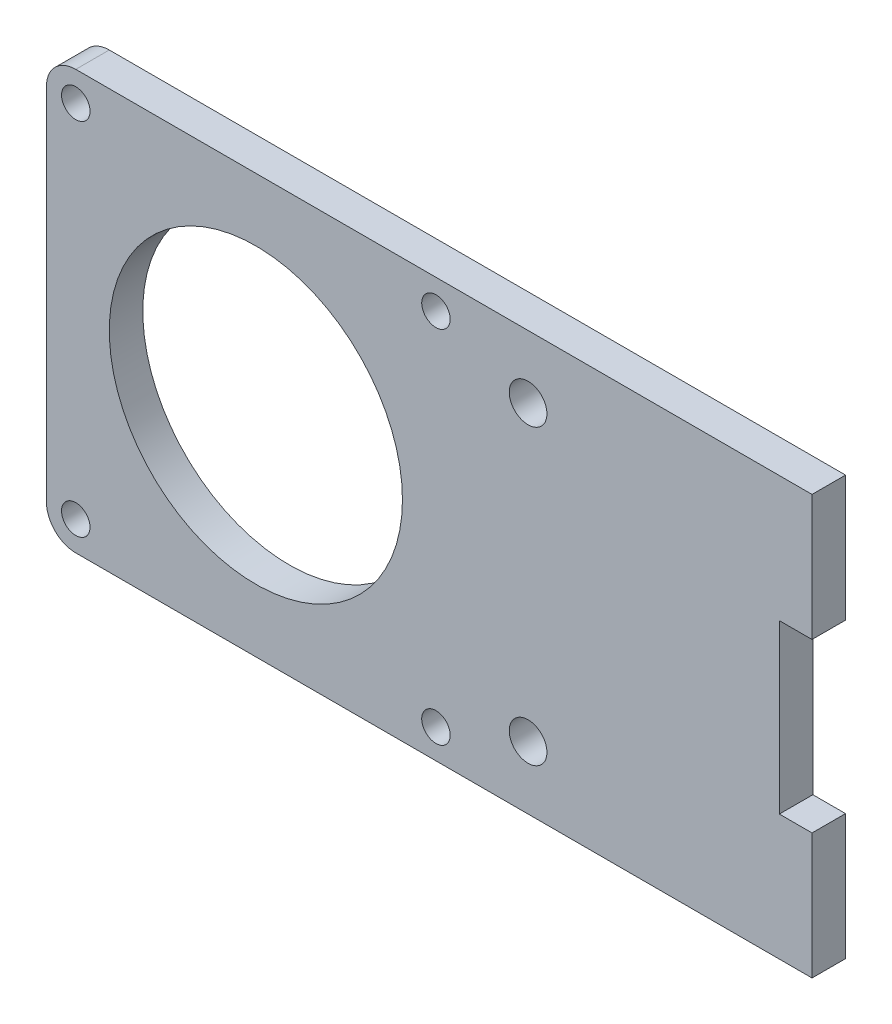
ISO-10303-21;
HEADER;
FILE_DESCRIPTION(('STEP AP214'),'2;1');
FILE_NAME('part.step','',(''),(''),'','','');
FILE_SCHEMA(('AUTOMOTIVE_DESIGN { 1 0 10303 214 1 1 1 1 }'));
ENDSEC;
DATA;
#1=APPLICATION_CONTEXT('core data for automotive mechanical design processes');
#2=APPLICATION_PROTOCOL_DEFINITION('international standard','automotive_design',2000,#1);
#3=PRODUCT_CONTEXT('',#1,'mechanical');
#4=PRODUCT('Part','Part','',(#3));
#5=PRODUCT_RELATED_PRODUCT_CATEGORY('part','',(#4));
#6=PRODUCT_DEFINITION_FORMATION('','',#4);
#7=PRODUCT_DEFINITION_CONTEXT('part definition',#1,'design');
#8=PRODUCT_DEFINITION('design','',#6,#7);
#9=PRODUCT_DEFINITION_SHAPE('','',#8);
#10=(LENGTH_UNIT() NAMED_UNIT(*) SI_UNIT(.MILLI.,.METRE.));
#11=(NAMED_UNIT(*) PLANE_ANGLE_UNIT() SI_UNIT($,.RADIAN.));
#12=(NAMED_UNIT(*) SI_UNIT($,.STERADIAN.) SOLID_ANGLE_UNIT());
#13=UNCERTAINTY_MEASURE_WITH_UNIT(LENGTH_MEASURE(1.E-05),#10,'distance_accuracy_value','');
#14=(GEOMETRIC_REPRESENTATION_CONTEXT(3) GLOBAL_UNCERTAINTY_ASSIGNED_CONTEXT((#13)) GLOBAL_UNIT_ASSIGNED_CONTEXT((#10,
#11,#12)) REPRESENTATION_CONTEXT('',''));
#15=CARTESIAN_POINT('',(0.,0.,0.));
#16=DIRECTION('',(0.,0.,1.));
#17=DIRECTION('',(1.,0.,0.));
#18=AXIS2_PLACEMENT_3D('',#15,#16,#17);
#19=CARTESIAN_POINT('',(0.,0.,4.));
#20=DIRECTION('',(-1.,0.,0.));
#21=DIRECTION('',(0.,0.,1.));
#22=AXIS2_PLACEMENT_3D('',#19,#20,#21);
#23=PLANE('',#22);
#24=DIRECTION('',(0.,1.,0.));
#25=VECTOR('',#24,1.);
#26=CARTESIAN_POINT('',(0.,0.,0.));
#27=LINE('',#26,#25);
#28=CARTESIAN_POINT('',(0.,15.,0.));
#29=VERTEX_POINT('',#28);
#30=CARTESIAN_POINT('',(0.,35.,0.));
#31=VERTEX_POINT('',#30);
#32=EDGE_CURVE('E150',#29,#31,#27,.T.);
#33=ORIENTED_EDGE('',*,*,#32,.T.);
#34=DIRECTION('',(0.,0.,-1.));
#35=VECTOR('',#34,1.);
#36=CARTESIAN_POINT('',(0.,35.,4.));
#37=LINE('',#36,#35);
#38=CARTESIAN_POINT('',(0.,35.,4.));
#39=VERTEX_POINT('',#38);
#40=EDGE_CURVE('E133',#39,#31,#37,.T.);
#41=ORIENTED_EDGE('',*,*,#40,.F.);
#42=DIRECTION('',(0.,1.,0.));
#43=VECTOR('',#42,1.);
#44=CARTESIAN_POINT('',(0.,0.,4.));
#45=LINE('',#44,#43);
#46=CARTESIAN_POINT('',(0.,15.,4.));
#47=VERTEX_POINT('',#46);
#48=EDGE_CURVE('E139',#47,#39,#45,.T.);
#49=ORIENTED_EDGE('',*,*,#48,.F.);
#50=DIRECTION('',(0.,0.,-1.));
#51=VECTOR('',#50,1.);
#52=CARTESIAN_POINT('',(0.,15.,4.));
#53=LINE('',#52,#51);
#54=EDGE_CURVE('E204',#47,#29,#53,.T.);
#55=ORIENTED_EDGE('',*,*,#54,.T.);
#56=EDGE_LOOP('',(#33,#41,#49,#55));
#57=FACE_BOUND('',#56,.T.);
#58=ADVANCED_FACE('F47',(#57),#23,.F.);
#59=CARTESIAN_POINT('',(0.,35.,4.));
#60=DIRECTION('',(0.,1.,0.));
#61=DIRECTION('',(0.,0.,1.));
#62=AXIS2_PLACEMENT_3D('',#59,#60,#61);
#63=PLANE('',#62);
#64=DIRECTION('',(1.,0.,0.));
#65=VECTOR('',#64,1.);
#66=CARTESIAN_POINT('',(0.,35.,0.));
#67=LINE('',#66,#65);
#68=CARTESIAN_POINT('',(3.9,35.,0.));
#69=VERTEX_POINT('',#68);
#70=EDGE_CURVE('E192',#31,#69,#67,.T.);
#71=ORIENTED_EDGE('',*,*,#70,.T.);
#72=DIRECTION('',(0.,0.,-1.));
#73=VECTOR('',#72,1.);
#74=CARTESIAN_POINT('',(3.9,35.,4.));
#75=LINE('',#74,#73);
#76=CARTESIAN_POINT('',(3.9,35.,4.));
#77=VERTEX_POINT('',#76);
#78=EDGE_CURVE('E135',#77,#69,#75,.T.);
#79=ORIENTED_EDGE('',*,*,#78,.F.);
#80=DIRECTION('',(1.,0.,0.));
#81=VECTOR('',#80,1.);
#82=CARTESIAN_POINT('',(0.,35.,4.));
#83=LINE('',#82,#81);
#84=EDGE_CURVE('E128',#39,#77,#83,.T.);
#85=ORIENTED_EDGE('',*,*,#84,.F.);
#86=ORIENTED_EDGE('',*,*,#40,.T.);
#87=EDGE_LOOP('',(#71,#79,#85,#86));
#88=FACE_BOUND('',#87,.T.);
#89=ADVANCED_FACE('F131',(#88),#63,.F.);
#90=CARTESIAN_POINT('',(3.90000000000001,0.,4.));
#91=DIRECTION('',(1.,0.,0.));
#92=DIRECTION('',(0.,1.,0.));
#93=AXIS2_PLACEMENT_3D('',#90,#91,#92);
#94=PLANE('',#93);
#95=DIRECTION('',(0.,-1.,0.));
#96=VECTOR('',#95,1.);
#97=CARTESIAN_POINT('',(3.90000000000001,0.,0.));
#98=LINE('',#97,#96);
#99=CARTESIAN_POINT('',(3.9,50.,0.));
#100=VERTEX_POINT('',#99);
#101=EDGE_CURVE('E188',#100,#69,#98,.T.);
#102=ORIENTED_EDGE('',*,*,#101,.F.);
#103=DIRECTION('',(0.,0.,-1.));
#104=VECTOR('',#103,1.);
#105=CARTESIAN_POINT('',(3.9,50.,4.));
#106=LINE('',#105,#104);
#107=CARTESIAN_POINT('',(3.9,50.,4.));
#108=VERTEX_POINT('',#107);
#109=EDGE_CURVE('E155',#108,#100,#106,.T.);
#110=ORIENTED_EDGE('',*,*,#109,.F.);
#111=DIRECTION('',(0.,-1.,0.));
#112=VECTOR('',#111,1.);
#113=CARTESIAN_POINT('',(3.90000000000001,0.,4.));
#114=LINE('',#113,#112);
#115=EDGE_CURVE('E138',#108,#77,#114,.T.);
#116=ORIENTED_EDGE('',*,*,#115,.T.);
#117=ORIENTED_EDGE('',*,*,#78,.T.);
#118=EDGE_LOOP('',(#102,#110,#116,#117));
#119=FACE_BOUND('',#118,.T.);
#120=ADVANCED_FACE('F231',(#119),#94,.T.);
#121=CARTESIAN_POINT('',(0.,50.,4.));
#122=DIRECTION('',(0.,-1.,0.));
#123=DIRECTION('',(0.,0.,-1.));
#124=AXIS2_PLACEMENT_3D('',#121,#122,#123);
#125=PLANE('',#124);
#126=DIRECTION('',(-1.,0.,0.));
#127=VECTOR('',#126,1.);
#128=CARTESIAN_POINT('',(0.,50.,0.));
#129=LINE('',#128,#127);
#130=CARTESIAN_POINT('',(-84.,50.,0.));
#131=VERTEX_POINT('',#130);
#132=EDGE_CURVE('E184',#100,#131,#129,.T.);
#133=ORIENTED_EDGE('',*,*,#132,.T.);
#134=DIRECTION('',(0.,0.,-1.));
#135=VECTOR('',#134,1.);
#136=CARTESIAN_POINT('',(-84.,50.,4.));
#137=LINE('',#136,#135);
#138=CARTESIAN_POINT('',(-84.,50.,4.));
#139=VERTEX_POINT('',#138);
#140=EDGE_CURVE('E70',#131,#139,#137,.F.);
#141=ORIENTED_EDGE('',*,*,#140,.T.);
#142=DIRECTION('',(-1.,0.,0.));
#143=VECTOR('',#142,1.);
#144=CARTESIAN_POINT('',(0.,50.,4.));
#145=LINE('',#144,#143);
#146=EDGE_CURVE('E169',#108,#139,#145,.T.);
#147=ORIENTED_EDGE('',*,*,#146,.F.);
#148=ORIENTED_EDGE('',*,*,#109,.T.);
#149=EDGE_LOOP('',(#133,#141,#147,#148));
#150=FACE_BOUND('',#149,.T.);
#151=ADVANCED_FACE('F187',(#150),#125,.F.);
#152=CARTESIAN_POINT('',(-87.5,0.,4.));
#153=DIRECTION('',(-1.,0.,0.));
#154=DIRECTION('',(0.,0.,1.));
#155=AXIS2_PLACEMENT_3D('',#152,#153,#154);
#156=PLANE('',#155);
#157=DIRECTION('',(0.,1.,0.));
#158=VECTOR('',#157,1.);
#159=CARTESIAN_POINT('',(-87.5,0.,4.));
#160=LINE('',#159,#158);
#161=CARTESIAN_POINT('',(-87.5,3.5,4.));
#162=VERTEX_POINT('',#161);
#163=CARTESIAN_POINT('',(-87.5,46.5,4.));
#164=VERTEX_POINT('',#163);
#165=EDGE_CURVE('E168',#162,#164,#160,.T.);
#166=ORIENTED_EDGE('',*,*,#165,.T.);
#167=DIRECTION('',(0.,0.,-1.));
#168=VECTOR('',#167,1.);
#169=CARTESIAN_POINT('',(-87.5,46.5,0.));
#170=LINE('',#169,#168);
#171=CARTESIAN_POINT('',(-87.5,46.5,0.));
#172=VERTEX_POINT('',#171);
#173=EDGE_CURVE('E153',#164,#172,#170,.T.);
#174=ORIENTED_EDGE('',*,*,#173,.T.);
#175=DIRECTION('',(0.,1.,0.));
#176=VECTOR('',#175,1.);
#177=CARTESIAN_POINT('',(-87.5,0.,0.));
#178=LINE('',#177,#176);
#179=CARTESIAN_POINT('',(-87.5,3.5,0.));
#180=VERTEX_POINT('',#179);
#181=EDGE_CURVE('E186',#180,#172,#178,.T.);
#182=ORIENTED_EDGE('',*,*,#181,.F.);
#183=DIRECTION('',(0.,0.,-1.));
#184=VECTOR('',#183,1.);
#185=CARTESIAN_POINT('',(-87.5,3.5,4.));
#186=LINE('',#185,#184);
#187=EDGE_CURVE('E151',#180,#162,#186,.F.);
#188=ORIENTED_EDGE('',*,*,#187,.T.);
#189=EDGE_LOOP('',(#166,#174,#182,#188));
#190=FACE_BOUND('',#189,.T.);
#191=ADVANCED_FACE('F173',(#190),#156,.T.);
#192=CARTESIAN_POINT('',(0.,0.,4.));
#193=DIRECTION('',(0.,-1.,0.));
#194=DIRECTION('',(0.,0.,-1.));
#195=AXIS2_PLACEMENT_3D('',#192,#193,#194);
#196=PLANE('',#195);
#197=DIRECTION('',(-1.,0.,0.));
#198=VECTOR('',#197,1.);
#199=CARTESIAN_POINT('',(0.,0.,4.));
#200=LINE('',#199,#198);
#201=CARTESIAN_POINT('',(3.9,0.,4.));
#202=VERTEX_POINT('',#201);
#203=CARTESIAN_POINT('',(-84.,0.,4.));
#204=VERTEX_POINT('',#203);
#205=EDGE_CURVE('E177',#202,#204,#200,.T.);
#206=ORIENTED_EDGE('',*,*,#205,.T.);
#207=DIRECTION('',(0.,0.,-1.));
#208=VECTOR('',#207,1.);
#209=CARTESIAN_POINT('',(-84.,0.,4.));
#210=LINE('',#209,#208);
#211=CARTESIAN_POINT('',(-84.,0.,0.));
#212=VERTEX_POINT('',#211);
#213=EDGE_CURVE('E12',#204,#212,#210,.T.);
#214=ORIENTED_EDGE('',*,*,#213,.T.);
#215=DIRECTION('',(-1.,0.,0.));
#216=VECTOR('',#215,1.);
#217=CARTESIAN_POINT('',(0.,0.,0.));
#218=LINE('',#217,#216);
#219=CARTESIAN_POINT('',(3.9,0.,0.));
#220=VERTEX_POINT('',#219);
#221=EDGE_CURVE('E190',#220,#212,#218,.T.);
#222=ORIENTED_EDGE('',*,*,#221,.F.);
#223=DIRECTION('',(0.,0.,-1.));
#224=VECTOR('',#223,1.);
#225=CARTESIAN_POINT('',(3.9,0.,4.));
#226=LINE('',#225,#224);
#227=EDGE_CURVE('E208',#202,#220,#226,.T.);
#228=ORIENTED_EDGE('',*,*,#227,.F.);
#229=EDGE_LOOP('',(#206,#214,#222,#228));
#230=FACE_BOUND('',#229,.T.);
#231=ADVANCED_FACE('F218',(#230),#196,.T.);
#232=CARTESIAN_POINT('',(3.9,0.,4.));
#233=DIRECTION('',(-1.,0.,0.));
#234=DIRECTION('',(0.,0.,1.));
#235=AXIS2_PLACEMENT_3D('',#232,#233,#234);
#236=PLANE('',#235);
#237=DIRECTION('',(0.,1.,0.));
#238=VECTOR('',#237,1.);
#239=CARTESIAN_POINT('',(3.9,0.,0.));
#240=LINE('',#239,#238);
#241=CARTESIAN_POINT('',(3.9,15.,0.));
#242=VERTEX_POINT('',#241);
#243=EDGE_CURVE('E198',#220,#242,#240,.T.);
#244=ORIENTED_EDGE('',*,*,#243,.T.);
#245=DIRECTION('',(0.,0.,-1.));
#246=VECTOR('',#245,1.);
#247=CARTESIAN_POINT('',(3.9,15.,4.));
#248=LINE('',#247,#246);
#249=CARTESIAN_POINT('',(3.9,15.,4.));
#250=VERTEX_POINT('',#249);
#251=EDGE_CURVE('E206',#250,#242,#248,.T.);
#252=ORIENTED_EDGE('',*,*,#251,.F.);
#253=DIRECTION('',(0.,1.,0.));
#254=VECTOR('',#253,1.);
#255=CARTESIAN_POINT('',(3.9,0.,4.));
#256=LINE('',#255,#254);
#257=EDGE_CURVE('E214',#202,#250,#256,.T.);
#258=ORIENTED_EDGE('',*,*,#257,.F.);
#259=ORIENTED_EDGE('',*,*,#227,.T.);
#260=EDGE_LOOP('',(#244,#252,#258,#259));
#261=FACE_BOUND('',#260,.T.);
#262=ADVANCED_FACE('F212',(#261),#236,.F.);
#263=CARTESIAN_POINT('',(-62.5,25.,4.));
#264=DIRECTION('',(0.,0.,-1.));
#265=DIRECTION('',(-1.,0.,0.));
#266=AXIS2_PLACEMENT_3D('',#263,#264,#265);
#267=CYLINDRICAL_SURFACE('',#266,17.5);
#268=CARTESIAN_POINT('',(-62.5,25.,4.));
#269=DIRECTION('',(0.,0.,1.));
#270=DIRECTION('',(1.,0.,0.));
#271=AXIS2_PLACEMENT_3D('',#268,#269,#270);
#272=CIRCLE('',#271,17.5);
#273=CARTESIAN_POINT('',(-45.,25.,4.));
#274=VERTEX_POINT('',#273);
#275=EDGE_CURVE('E147',#274,#274,#272,.T.);
#276=ORIENTED_EDGE('',*,*,#275,.T.);
#277=EDGE_LOOP('',(#276));
#278=FACE_BOUND('',#277,.T.);
#279=CARTESIAN_POINT('',(-62.5,25.,0.));
#280=DIRECTION('',(0.,0.,1.));
#281=DIRECTION('',(1.,0.,0.));
#282=AXIS2_PLACEMENT_3D('',#279,#280,#281);
#283=CIRCLE('',#282,17.5);
#284=CARTESIAN_POINT('',(-45.,25.,0.));
#285=VERTEX_POINT('',#284);
#286=EDGE_CURVE('E251',#285,#285,#283,.T.);
#287=ORIENTED_EDGE('',*,*,#286,.F.);
#288=EDGE_LOOP('',(#287));
#289=FACE_BOUND('',#288,.T.);
#290=ADVANCED_FACE('F235',(#278,#289),#267,.F.);
#291=CARTESIAN_POINT('',(0.,15.,4.));
#292=DIRECTION('',(0.,1.,0.));
#293=DIRECTION('',(0.,0.,1.));
#294=AXIS2_PLACEMENT_3D('',#291,#292,#293);
#295=PLANE('',#294);
#296=DIRECTION('',(1.,0.,0.));
#297=VECTOR('',#296,1.);
#298=CARTESIAN_POINT('',(0.,15.,0.));
#299=LINE('',#298,#297);
#300=EDGE_CURVE('E201',#29,#242,#299,.T.);
#301=ORIENTED_EDGE('',*,*,#300,.F.);
#302=ORIENTED_EDGE('',*,*,#54,.F.);
#303=DIRECTION('',(1.,0.,0.));
#304=VECTOR('',#303,1.);
#305=CARTESIAN_POINT('',(0.,15.,4.));
#306=LINE('',#305,#304);
#307=EDGE_CURVE('E145',#47,#250,#306,.T.);
#308=ORIENTED_EDGE('',*,*,#307,.T.);
#309=ORIENTED_EDGE('',*,*,#251,.T.);
#310=EDGE_LOOP('',(#301,#302,#308,#309));
#311=FACE_BOUND('',#310,.T.);
#312=ADVANCED_FACE('F237',(#311),#295,.T.);
#313=CARTESIAN_POINT('',(0.,0.,4.));
#314=DIRECTION('',(0.,0.,1.));
#315=DIRECTION('',(1.,0.,0.));
#316=AXIS2_PLACEMENT_3D('',#313,#314,#315);
#317=PLANE('',#316);
#318=CARTESIAN_POINT('',(-30.,42.5,4.));
#319=DIRECTION('',(0.,0.,1.));
#320=DIRECTION('',(1.,0.,0.));
#321=AXIS2_PLACEMENT_3D('',#318,#319,#320);
#322=CIRCLE('',#321,2.25);
#323=CARTESIAN_POINT('',(-27.75,42.5,4.));
#324=VERTEX_POINT('',#323);
#325=EDGE_CURVE('E296',#324,#324,#322,.T.);
#326=ORIENTED_EDGE('',*,*,#325,.F.);
#327=EDGE_LOOP('',(#326));
#328=FACE_BOUND('',#327,.T.);
#329=CARTESIAN_POINT('',(-30.,7.5,4.));
#330=DIRECTION('',(0.,0.,1.));
#331=DIRECTION('',(1.,0.,0.));
#332=AXIS2_PLACEMENT_3D('',#329,#330,#331);
#333=CIRCLE('',#332,2.25);
#334=CARTESIAN_POINT('',(-27.75,7.5,4.));
#335=VERTEX_POINT('',#334);
#336=EDGE_CURVE('E290',#335,#335,#333,.T.);
#337=ORIENTED_EDGE('',*,*,#336,.F.);
#338=EDGE_LOOP('',(#337));
#339=FACE_BOUND('',#338,.T.);
#340=CARTESIAN_POINT('',(-84.,46.5,4.));
#341=DIRECTION('',(0.,0.,1.));
#342=DIRECTION('',(1.,0.,0.));
#343=AXIS2_PLACEMENT_3D('',#340,#341,#342);
#344=CIRCLE('',#343,1.69999999999999);
#345=CARTESIAN_POINT('',(-82.3,46.5,4.));
#346=VERTEX_POINT('',#345);
#347=EDGE_CURVE('E284',#346,#346,#344,.T.);
#348=ORIENTED_EDGE('',*,*,#347,.F.);
#349=EDGE_LOOP('',(#348));
#350=FACE_BOUND('',#349,.T.);
#351=CARTESIAN_POINT('',(-41.,46.5,4.));
#352=DIRECTION('',(0.,0.,1.));
#353=DIRECTION('',(1.,0.,0.));
#354=AXIS2_PLACEMENT_3D('',#351,#352,#353);
#355=CIRCLE('',#354,1.69999999999999);
#356=CARTESIAN_POINT('',(-39.3,46.5,4.));
#357=VERTEX_POINT('',#356);
#358=EDGE_CURVE('E278',#357,#357,#355,.T.);
#359=ORIENTED_EDGE('',*,*,#358,.F.);
#360=EDGE_LOOP('',(#359));
#361=FACE_BOUND('',#360,.T.);
#362=CARTESIAN_POINT('',(-41.,3.5,4.));
#363=DIRECTION('',(0.,0.,1.));
#364=DIRECTION('',(1.,0.,0.));
#365=AXIS2_PLACEMENT_3D('',#362,#363,#364);
#366=CIRCLE('',#365,1.69999999999999);
#367=CARTESIAN_POINT('',(-39.3,3.5,4.));
#368=VERTEX_POINT('',#367);
#369=EDGE_CURVE('E272',#368,#368,#366,.T.);
#370=ORIENTED_EDGE('',*,*,#369,.F.);
#371=EDGE_LOOP('',(#370));
#372=FACE_BOUND('',#371,.T.);
#373=CARTESIAN_POINT('',(-84.,3.50000000000001,4.));
#374=DIRECTION('',(0.,0.,1.));
#375=DIRECTION('',(1.,0.,0.));
#376=AXIS2_PLACEMENT_3D('',#373,#374,#375);
#377=CIRCLE('',#376,1.69999999999999);
#378=CARTESIAN_POINT('',(-82.3,3.50000000000001,4.));
#379=VERTEX_POINT('',#378);
#380=EDGE_CURVE('E257',#379,#379,#377,.T.);
#381=ORIENTED_EDGE('',*,*,#380,.F.);
#382=EDGE_LOOP('',(#381));
#383=FACE_BOUND('',#382,.T.);
#384=ORIENTED_EDGE('',*,*,#275,.F.);
#385=EDGE_LOOP('',(#384));
#386=FACE_BOUND('',#385,.T.);
#387=ORIENTED_EDGE('',*,*,#146,.T.);
#388=CARTESIAN_POINT('',(-84.,46.5,4.));
#389=DIRECTION('',(0.,0.,1.));
#390=DIRECTION('',(1.,0.,0.));
#391=AXIS2_PLACEMENT_3D('',#388,#389,#390);
#392=CIRCLE('',#391,3.5);
#393=EDGE_CURVE('E55',#139,#164,#392,.T.);
#394=ORIENTED_EDGE('',*,*,#393,.T.);
#395=ORIENTED_EDGE('',*,*,#165,.F.);
#396=CARTESIAN_POINT('',(-84.,3.5,4.));
#397=DIRECTION('',(0.,0.,1.));
#398=DIRECTION('',(1.,0.,0.));
#399=AXIS2_PLACEMENT_3D('',#396,#397,#398);
#400=CIRCLE('',#399,3.5);
#401=EDGE_CURVE('E62',#162,#204,#400,.T.);
#402=ORIENTED_EDGE('',*,*,#401,.T.);
#403=ORIENTED_EDGE('',*,*,#205,.F.);
#404=ORIENTED_EDGE('',*,*,#257,.T.);
#405=ORIENTED_EDGE('',*,*,#307,.F.);
#406=ORIENTED_EDGE('',*,*,#48,.T.);
#407=ORIENTED_EDGE('',*,*,#84,.T.);
#408=ORIENTED_EDGE('',*,*,#115,.F.);
#409=EDGE_LOOP('',(#387,#394,#395,#402,#403,#404,#405,#406,#407,#408));
#410=FACE_BOUND('',#409,.T.);
#411=ADVANCED_FACE('F143',(#328,#339,#350,#361,#372,#383,#386,#410),#317,.T.);
#412=CARTESIAN_POINT('',(0.,0.,0.));
#413=DIRECTION('',(0.,0.,1.));
#414=DIRECTION('',(1.,0.,0.));
#415=AXIS2_PLACEMENT_3D('',#412,#413,#414);
#416=PLANE('',#415);
#417=CARTESIAN_POINT('',(-30.,42.5,0.));
#418=DIRECTION('',(0.,0.,1.));
#419=DIRECTION('',(1.,0.,0.));
#420=AXIS2_PLACEMENT_3D('',#417,#418,#419);
#421=CIRCLE('',#420,2.25);
#422=CARTESIAN_POINT('',(-27.75,42.5,0.));
#423=VERTEX_POINT('',#422);
#424=EDGE_CURVE('E293',#423,#423,#421,.T.);
#425=ORIENTED_EDGE('',*,*,#424,.T.);
#426=EDGE_LOOP('',(#425));
#427=FACE_BOUND('',#426,.T.);
#428=CARTESIAN_POINT('',(-30.,7.5,0.));
#429=DIRECTION('',(0.,0.,1.));
#430=DIRECTION('',(1.,0.,0.));
#431=AXIS2_PLACEMENT_3D('',#428,#429,#430);
#432=CIRCLE('',#431,2.25);
#433=CARTESIAN_POINT('',(-27.75,7.5,0.));
#434=VERTEX_POINT('',#433);
#435=EDGE_CURVE('E287',#434,#434,#432,.T.);
#436=ORIENTED_EDGE('',*,*,#435,.T.);
#437=EDGE_LOOP('',(#436));
#438=FACE_BOUND('',#437,.T.);
#439=CARTESIAN_POINT('',(-84.,46.5,0.));
#440=DIRECTION('',(0.,0.,1.));
#441=DIRECTION('',(1.,0.,0.));
#442=AXIS2_PLACEMENT_3D('',#439,#440,#441);
#443=CIRCLE('',#442,1.69999999999999);
#444=CARTESIAN_POINT('',(-82.3,46.5,0.));
#445=VERTEX_POINT('',#444);
#446=EDGE_CURVE('E281',#445,#445,#443,.T.);
#447=ORIENTED_EDGE('',*,*,#446,.T.);
#448=EDGE_LOOP('',(#447));
#449=FACE_BOUND('',#448,.T.);
#450=CARTESIAN_POINT('',(-41.,46.5,0.));
#451=DIRECTION('',(0.,0.,1.));
#452=DIRECTION('',(1.,0.,0.));
#453=AXIS2_PLACEMENT_3D('',#450,#451,#452);
#454=CIRCLE('',#453,1.7);
#455=CARTESIAN_POINT('',(-39.3,46.5,0.));
#456=VERTEX_POINT('',#455);
#457=EDGE_CURVE('E275',#456,#456,#454,.T.);
#458=ORIENTED_EDGE('',*,*,#457,.T.);
#459=EDGE_LOOP('',(#458));
#460=FACE_BOUND('',#459,.T.);
#461=CARTESIAN_POINT('',(-41.,3.5,0.));
#462=DIRECTION('',(0.,0.,1.));
#463=DIRECTION('',(1.,0.,0.));
#464=AXIS2_PLACEMENT_3D('',#461,#462,#463);
#465=CIRCLE('',#464,1.7);
#466=CARTESIAN_POINT('',(-39.3,3.5,0.));
#467=VERTEX_POINT('',#466);
#468=EDGE_CURVE('E269',#467,#467,#465,.T.);
#469=ORIENTED_EDGE('',*,*,#468,.T.);
#470=EDGE_LOOP('',(#469));
#471=FACE_BOUND('',#470,.T.);
#472=CARTESIAN_POINT('',(-84.,3.50000000000001,0.));
#473=DIRECTION('',(0.,0.,1.));
#474=DIRECTION('',(1.,0.,0.));
#475=AXIS2_PLACEMENT_3D('',#472,#473,#474);
#476=CIRCLE('',#475,1.69999999999999);
#477=CARTESIAN_POINT('',(-82.3,3.50000000000001,0.));
#478=VERTEX_POINT('',#477);
#479=EDGE_CURVE('E253',#478,#478,#476,.T.);
#480=ORIENTED_EDGE('',*,*,#479,.T.);
#481=EDGE_LOOP('',(#480));
#482=FACE_BOUND('',#481,.T.);
#483=ORIENTED_EDGE('',*,*,#286,.T.);
#484=EDGE_LOOP('',(#483));
#485=FACE_BOUND('',#484,.T.);
#486=ORIENTED_EDGE('',*,*,#181,.T.);
#487=CARTESIAN_POINT('',(-84.,46.5,0.));
#488=DIRECTION('',(0.,0.,1.));
#489=DIRECTION('',(1.,0.,0.));
#490=AXIS2_PLACEMENT_3D('',#487,#488,#489);
#491=CIRCLE('',#490,3.5);
#492=EDGE_CURVE('E163',#172,#131,#491,.F.);
#493=ORIENTED_EDGE('',*,*,#492,.T.);
#494=ORIENTED_EDGE('',*,*,#132,.F.);
#495=ORIENTED_EDGE('',*,*,#101,.T.);
#496=ORIENTED_EDGE('',*,*,#70,.F.);
#497=ORIENTED_EDGE('',*,*,#32,.F.);
#498=ORIENTED_EDGE('',*,*,#300,.T.);
#499=ORIENTED_EDGE('',*,*,#243,.F.);
#500=ORIENTED_EDGE('',*,*,#221,.T.);
#501=CARTESIAN_POINT('',(-84.,3.5,0.));
#502=DIRECTION('',(0.,0.,1.));
#503=DIRECTION('',(1.,0.,0.));
#504=AXIS2_PLACEMENT_3D('',#501,#502,#503);
#505=CIRCLE('',#504,3.5);
#506=EDGE_CURVE('E161',#212,#180,#505,.F.);
#507=ORIENTED_EDGE('',*,*,#506,.T.);
#508=EDGE_LOOP('',(#486,#493,#494,#495,#496,#497,#498,#499,#500,#507));
#509=FACE_BOUND('',#508,.T.);
#510=ADVANCED_FACE('F182',(#427,#438,#449,#460,#471,#482,#485,#509),#416,.F.);
#511=CARTESIAN_POINT('',(-84.,3.50000000000001,4.));
#512=DIRECTION('',(0.,0.,1.));
#513=DIRECTION('',(1.,0.,0.));
#514=AXIS2_PLACEMENT_3D('',#511,#512,#513);
#515=CYLINDRICAL_SURFACE('',#514,1.69999999999999);
#516=ORIENTED_EDGE('',*,*,#479,.F.);
#517=EDGE_LOOP('',(#516));
#518=FACE_BOUND('',#517,.T.);
#519=ORIENTED_EDGE('',*,*,#380,.T.);
#520=EDGE_LOOP('',(#519));
#521=FACE_BOUND('',#520,.T.);
#522=ADVANCED_FACE('F315',(#518,#521),#515,.F.);
#523=CARTESIAN_POINT('',(-41.,3.5,4.));
#524=DIRECTION('',(0.,0.,1.));
#525=DIRECTION('',(1.,0.,0.));
#526=AXIS2_PLACEMENT_3D('',#523,#524,#525);
#527=CYLINDRICAL_SURFACE('',#526,1.69999999999999);
#528=ORIENTED_EDGE('',*,*,#468,.F.);
#529=EDGE_LOOP('',(#528));
#530=FACE_BOUND('',#529,.T.);
#531=ORIENTED_EDGE('',*,*,#369,.T.);
#532=EDGE_LOOP('',(#531));
#533=FACE_BOUND('',#532,.T.);
#534=ADVANCED_FACE('F317',(#530,#533),#527,.F.);
#535=CARTESIAN_POINT('',(-41.,46.5,4.));
#536=DIRECTION('',(0.,0.,1.));
#537=DIRECTION('',(1.,0.,0.));
#538=AXIS2_PLACEMENT_3D('',#535,#536,#537);
#539=CYLINDRICAL_SURFACE('',#538,1.69999999999999);
#540=ORIENTED_EDGE('',*,*,#457,.F.);
#541=EDGE_LOOP('',(#540));
#542=FACE_BOUND('',#541,.T.);
#543=ORIENTED_EDGE('',*,*,#358,.T.);
#544=EDGE_LOOP('',(#543));
#545=FACE_BOUND('',#544,.T.);
#546=ADVANCED_FACE('F323',(#542,#545),#539,.F.);
#547=CARTESIAN_POINT('',(-84.,46.5,4.));
#548=DIRECTION('',(0.,0.,1.));
#549=DIRECTION('',(1.,0.,0.));
#550=AXIS2_PLACEMENT_3D('',#547,#548,#549);
#551=CYLINDRICAL_SURFACE('',#550,1.69999999999999);
#552=ORIENTED_EDGE('',*,*,#446,.F.);
#553=EDGE_LOOP('',(#552));
#554=FACE_BOUND('',#553,.T.);
#555=ORIENTED_EDGE('',*,*,#347,.T.);
#556=EDGE_LOOP('',(#555));
#557=FACE_BOUND('',#556,.T.);
#558=ADVANCED_FACE('F407',(#554,#557),#551,.F.);
#559=CARTESIAN_POINT('',(-30.,7.5,4.));
#560=DIRECTION('',(0.,0.,1.));
#561=DIRECTION('',(1.,0.,0.));
#562=AXIS2_PLACEMENT_3D('',#559,#560,#561);
#563=CYLINDRICAL_SURFACE('',#562,2.25);
#564=ORIENTED_EDGE('',*,*,#435,.F.);
#565=EDGE_LOOP('',(#564));
#566=FACE_BOUND('',#565,.T.);
#567=ORIENTED_EDGE('',*,*,#336,.T.);
#568=EDGE_LOOP('',(#567));
#569=FACE_BOUND('',#568,.T.);
#570=ADVANCED_FACE('F416',(#566,#569),#563,.F.);
#571=CARTESIAN_POINT('',(-30.,42.5,4.));
#572=DIRECTION('',(0.,0.,1.));
#573=DIRECTION('',(1.,0.,0.));
#574=AXIS2_PLACEMENT_3D('',#571,#572,#573);
#575=CYLINDRICAL_SURFACE('',#574,2.25);
#576=ORIENTED_EDGE('',*,*,#424,.F.);
#577=EDGE_LOOP('',(#576));
#578=FACE_BOUND('',#577,.T.);
#579=ORIENTED_EDGE('',*,*,#325,.T.);
#580=EDGE_LOOP('',(#579));
#581=FACE_BOUND('',#580,.T.);
#582=ADVANCED_FACE('F225',(#578,#581),#575,.F.);
#583=CARTESIAN_POINT('',(-84.,46.5,4.));
#584=DIRECTION('',(0.,0.,1.));
#585=DIRECTION('',(1.,0.,0.));
#586=AXIS2_PLACEMENT_3D('',#583,#584,#585);
#587=CYLINDRICAL_SURFACE('',#586,3.5);
#588=ORIENTED_EDGE('',*,*,#393,.F.);
#589=ORIENTED_EDGE('',*,*,#140,.F.);
#590=ORIENTED_EDGE('',*,*,#492,.F.);
#591=ORIENTED_EDGE('',*,*,#173,.F.);
#592=EDGE_LOOP('',(#588,#589,#590,#591));
#593=FACE_BOUND('',#592,.T.);
#594=ADVANCED_FACE('F179',(#593),#587,.T.);
#595=CARTESIAN_POINT('',(-84.,3.5,4.));
#596=DIRECTION('',(0.,0.,-1.));
#597=DIRECTION('',(-1.,0.,0.));
#598=AXIS2_PLACEMENT_3D('',#595,#596,#597);
#599=CYLINDRICAL_SURFACE('',#598,3.5);
#600=ORIENTED_EDGE('',*,*,#401,.F.);
#601=ORIENTED_EDGE('',*,*,#187,.F.);
#602=ORIENTED_EDGE('',*,*,#506,.F.);
#603=ORIENTED_EDGE('',*,*,#213,.F.);
#604=EDGE_LOOP('',(#600,#601,#602,#603));
#605=FACE_BOUND('',#604,.T.);
#606=ADVANCED_FACE('F49',(#605),#599,.T.);
#607=CLOSED_SHELL('',(#58,#89,#120,#151,#191,#231,#262,#290,#312,#411,#510,#522,#534,#546,#558,
#570,#582,#594,#606));
#608=MANIFOLD_SOLID_BREP('B2',#607);
#609=ADVANCED_BREP_SHAPE_REPRESENTATION('',(#18,#608),#14);
#610=SHAPE_DEFINITION_REPRESENTATION(#9,#609);
ENDSEC;
END-ISO-10303-21;
